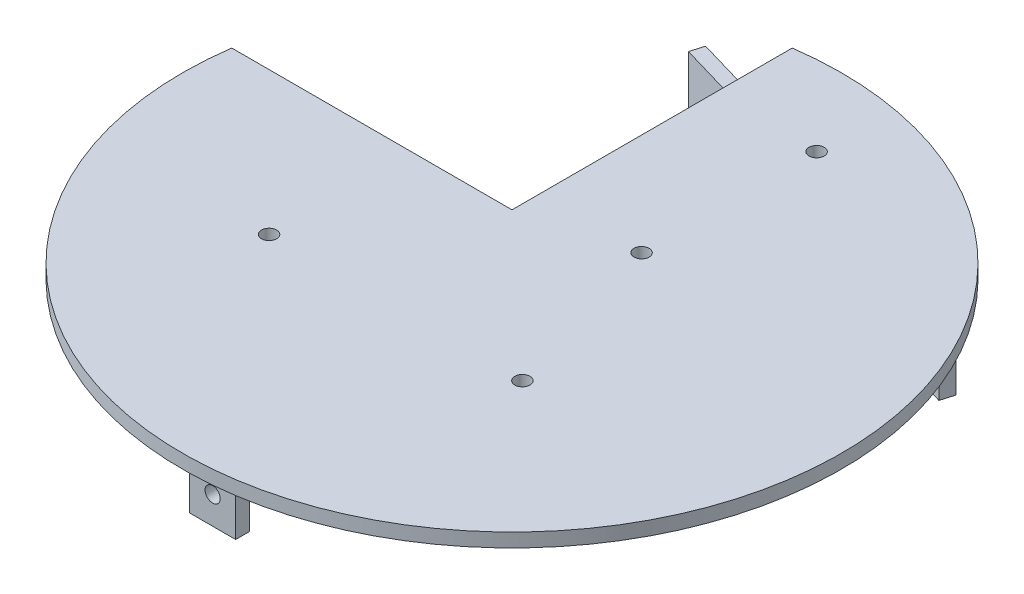
ISO-10303-21;
HEADER;
FILE_DESCRIPTION(('STEP AP214'),'2;1');
FILE_NAME('part.step','',(''),(''),'','','');
FILE_SCHEMA(('AUTOMOTIVE_DESIGN { 1 0 10303 214 1 1 1 1 }'));
ENDSEC;
DATA;
#1=APPLICATION_CONTEXT('core data for automotive mechanical design processes');
#2=APPLICATION_PROTOCOL_DEFINITION('international standard','automotive_design',2000,#1);
#3=PRODUCT_CONTEXT('',#1,'mechanical');
#4=PRODUCT('Part','Part','',(#3));
#5=PRODUCT_RELATED_PRODUCT_CATEGORY('part','',(#4));
#6=PRODUCT_DEFINITION_FORMATION('','',#4);
#7=PRODUCT_DEFINITION_CONTEXT('part definition',#1,'design');
#8=PRODUCT_DEFINITION('design','',#6,#7);
#9=PRODUCT_DEFINITION_SHAPE('','',#8);
#10=(LENGTH_UNIT() NAMED_UNIT(*) SI_UNIT(.MILLI.,.METRE.));
#11=(NAMED_UNIT(*) PLANE_ANGLE_UNIT() SI_UNIT($,.RADIAN.));
#12=(NAMED_UNIT(*) SI_UNIT($,.STERADIAN.) SOLID_ANGLE_UNIT());
#13=UNCERTAINTY_MEASURE_WITH_UNIT(LENGTH_MEASURE(1.E-05),#10,'distance_accuracy_value','');
#14=(GEOMETRIC_REPRESENTATION_CONTEXT(3) GLOBAL_UNCERTAINTY_ASSIGNED_CONTEXT((#13)) GLOBAL_UNIT_ASSIGNED_CONTEXT((#10,
#11,#12)) REPRESENTATION_CONTEXT('',''));
#15=CARTESIAN_POINT('',(0.,0.,0.));
#16=DIRECTION('',(0.,0.,1.));
#17=DIRECTION('',(1.,0.,0.));
#18=AXIS2_PLACEMENT_3D('',#15,#16,#17);
#19=CARTESIAN_POINT('',(0.,0.,0.));
#20=DIRECTION('',(0.,1.,0.));
#21=DIRECTION('',(0.,0.,1.));
#22=AXIS2_PLACEMENT_3D('',#19,#20,#21);
#23=PLANE('',#22);
#24=DIRECTION('',(0.959952117145582,0.,0.280164117594874));
#25=VECTOR('',#24,1.);
#26=CARTESIAN_POINT('',(-290184.643714966,0.,-84749.1679164852));
#27=LINE('',#26,#25);
#28=CARTESIAN_POINT('',(-9.99999999993861,0.,-61.065715569513));
#29=VERTEX_POINT('',#28);
#30=CARTESIAN_POINT('',(10.8113995060544,0.,-54.9918632654588));
#31=VERTEX_POINT('',#30);
#32=EDGE_CURVE('E11',#29,#31,#27,.T.);
#33=ORIENTED_EDGE('',*,*,#32,.F.);
#34=DIRECTION('',(0.,0.,1.));
#35=VECTOR('',#34,1.);
#36=CARTESIAN_POINT('',(-10.,0.,-70.8426921072315));
#37=LINE('',#36,#35);
#38=CARTESIAN_POINT('',(-10.,0.,-70.8426921072315));
#39=VERTEX_POINT('',#38);
#40=EDGE_CURVE('E238',#39,#29,#37,.T.);
#41=ORIENTED_EDGE('',*,*,#40,.F.);
#42=CARTESIAN_POINT('',(0.,0.,0.));
#43=DIRECTION('',(0.,1.,0.));
#44=DIRECTION('',(0.,0.,1.));
#45=AXIS2_PLACEMENT_3D('',#42,#43,#44);
#46=CIRCLE('',#45,71.545);
#47=CARTESIAN_POINT('',(-70.8426921072315,0.,-10.));
#48=VERTEX_POINT('',#47);
#49=EDGE_CURVE('E232',#48,#39,#46,.T.);
#50=ORIENTED_EDGE('',*,*,#49,.F.);
#51=DIRECTION('',(-1.,0.,0.));
#52=VECTOR('',#51,1.);
#53=CARTESIAN_POINT('',(-70.8426921072315,0.,-10.));
#54=LINE('',#53,#52);
#55=CARTESIAN_POINT('',(-10.,0.,-10.));
#56=VERTEX_POINT('',#55);
#57=EDGE_CURVE('E241',#56,#48,#54,.T.);
#58=ORIENTED_EDGE('',*,*,#57,.F.);
#59=CARTESIAN_POINT('',(-9.99999999993861,0.,-57.9405596931031));
#60=VERTEX_POINT('',#59);
#61=EDGE_CURVE('E225',#60,#56,#37,.T.);
#62=ORIENTED_EDGE('',*,*,#61,.F.);
#63=DIRECTION('',(-0.959952117145582,0.,-0.280164117594874));
#64=VECTOR('',#63,1.);
#65=CARTESIAN_POINT('',(-290185.484207319,0.,-84746.2880601338));
#66=LINE('',#65,#64);
#67=CARTESIAN_POINT('',(53.1959392302213,0.,-39.4966870939015));
#68=VERTEX_POINT('',#67);
#69=EDGE_CURVE('E181',#68,#60,#66,.T.);
#70=ORIENTED_EDGE('',*,*,#69,.F.);
#71=DIRECTION('',(-0.280164117594875,0.,0.959952117145582));
#72=VECTOR('',#71,1.);
#73=CARTESIAN_POINT('',(-109761.319853451,0.,376228.09187304));
#74=LINE('',#73,#72);
#75=CARTESIAN_POINT('',(54.0364315830004,0.,-42.3765434453003));
#76=VERTEX_POINT('',#75);
#77=EDGE_CURVE('E174',#76,#68,#74,.T.);
#78=ORIENTED_EDGE('',*,*,#77,.F.);
#79=CARTESIAN_POINT('',(13.7751131128112,0.,-54.126896989943));
#80=VERTEX_POINT('',#79);
#81=EDGE_CURVE('E48',#80,#76,#27,.T.);
#82=ORIENTED_EDGE('',*,*,#81,.F.);
#83=CARTESIAN_POINT('',(12.13,0.,-54.));
#84=DIRECTION('',(0.,1.,0.));
#85=DIRECTION('',(0.,0.,1.));
#86=AXIS2_PLACEMENT_3D('',#83,#84,#85);
#87=CIRCLE('',#86,1.65);
#88=EDGE_CURVE('E219',#80,#31,#87,.T.);
#89=ORIENTED_EDGE('',*,*,#88,.T.);
#90=EDGE_LOOP('',(#33,#41,#50,#58,#62,#70,#78,#82,#89));
#91=FACE_BOUND('',#90,.T.);
#92=CARTESIAN_POINT('',(12.13,0.,-16.));
#93=DIRECTION('',(0.,1.,0.));
#94=DIRECTION('',(0.,0.,1.));
#95=AXIS2_PLACEMENT_3D('',#92,#93,#94);
#96=CIRCLE('',#95,1.65);
#97=CARTESIAN_POINT('',(12.13,0.,-14.35));
#98=VERTEX_POINT('',#97);
#99=EDGE_CURVE('E218',#98,#98,#96,.T.);
#100=ORIENTED_EDGE('',*,*,#99,.T.);
#101=EDGE_LOOP('',(#100));
#102=FACE_BOUND('',#101,.T.);
#103=CARTESIAN_POINT('',(23.25,0.,21.));
#104=DIRECTION('',(0.,1.,0.));
#105=DIRECTION('',(0.,0.,1.));
#106=AXIS2_PLACEMENT_3D('',#103,#104,#105);
#107=CIRCLE('',#106,1.65);
#108=CARTESIAN_POINT('',(23.25,0.,22.65));
#109=VERTEX_POINT('',#108);
#110=EDGE_CURVE('E206',#109,#109,#107,.T.);
#111=ORIENTED_EDGE('',*,*,#110,.T.);
#112=EDGE_LOOP('',(#111));
#113=FACE_BOUND('',#112,.T.);
#114=CARTESIAN_POINT('',(-31.75,0.,21.));
#115=DIRECTION('',(0.,1.,0.));
#116=DIRECTION('',(0.,0.,1.));
#117=AXIS2_PLACEMENT_3D('',#114,#115,#116);
#118=CIRCLE('',#117,1.65);
#119=CARTESIAN_POINT('',(-31.75,0.,22.65));
#120=VERTEX_POINT('',#119);
#121=EDGE_CURVE('E202',#120,#120,#118,.T.);
#122=ORIENTED_EDGE('',*,*,#121,.T.);
#123=EDGE_LOOP('',(#122));
#124=FACE_BOUND('',#123,.T.);
#125=DIRECTION('',(0.,0.,-1.));
#126=VECTOR('',#125,1.);
#127=CARTESIAN_POINT('',(-5.,0.,62.));
#128=LINE('',#127,#126);
#129=CARTESIAN_POINT('',(-5.,0.,65.));
#130=VERTEX_POINT('',#129);
#131=CARTESIAN_POINT('',(-5.,0.,62.));
#132=VERTEX_POINT('',#131);
#133=EDGE_CURVE('E157',#130,#132,#128,.T.);
#134=ORIENTED_EDGE('',*,*,#133,.F.);
#135=DIRECTION('',(-1.,0.,0.));
#136=VECTOR('',#135,1.);
#137=CARTESIAN_POINT('',(-5.,0.,65.));
#138=LINE('',#137,#136);
#139=CARTESIAN_POINT('',(5.,0.,65.));
#140=VERTEX_POINT('',#139);
#141=EDGE_CURVE('E154',#140,#130,#138,.T.);
#142=ORIENTED_EDGE('',*,*,#141,.F.);
#143=DIRECTION('',(0.,0.,1.));
#144=VECTOR('',#143,1.);
#145=CARTESIAN_POINT('',(5.,0.,62.));
#146=LINE('',#145,#144);
#147=CARTESIAN_POINT('',(5.,0.,62.));
#148=VERTEX_POINT('',#147);
#149=EDGE_CURVE('E62',#148,#140,#146,.T.);
#150=ORIENTED_EDGE('',*,*,#149,.F.);
#151=DIRECTION('',(1.,0.,0.));
#152=VECTOR('',#151,1.);
#153=CARTESIAN_POINT('',(-5.,0.,62.));
#154=LINE('',#153,#152);
#155=EDGE_CURVE('E57',#132,#148,#154,.T.);
#156=ORIENTED_EDGE('',*,*,#155,.F.);
#157=EDGE_LOOP('',(#134,#142,#150,#156));
#158=FACE_BOUND('',#157,.T.);
#159=ADVANCED_FACE('F39',(#91,#102,#113,#124,#158),#23,.F.);
#160=CARTESIAN_POINT('',(0.,3.,0.));
#161=DIRECTION('',(0.,1.,0.));
#162=DIRECTION('',(0.,0.,1.));
#163=AXIS2_PLACEMENT_3D('',#160,#161,#162);
#164=PLANE('',#163);
#165=CARTESIAN_POINT('',(23.25,3.,21.));
#166=DIRECTION('',(0.,1.,0.));
#167=DIRECTION('',(0.,0.,1.));
#168=AXIS2_PLACEMENT_3D('',#165,#166,#167);
#169=CIRCLE('',#168,1.65);
#170=CARTESIAN_POINT('',(23.25,3.,22.65));
#171=VERTEX_POINT('',#170);
#172=EDGE_CURVE('E209',#171,#171,#169,.T.);
#173=ORIENTED_EDGE('',*,*,#172,.F.);
#174=EDGE_LOOP('',(#173));
#175=FACE_BOUND('',#174,.T.);
#176=CARTESIAN_POINT('',(12.13,3.,-16.));
#177=DIRECTION('',(0.,1.,0.));
#178=DIRECTION('',(0.,0.,1.));
#179=AXIS2_PLACEMENT_3D('',#176,#177,#178);
#180=CIRCLE('',#179,1.65);
#181=CARTESIAN_POINT('',(12.13,3.,-14.35));
#182=VERTEX_POINT('',#181);
#183=EDGE_CURVE('E222',#182,#182,#180,.T.);
#184=ORIENTED_EDGE('',*,*,#183,.F.);
#185=EDGE_LOOP('',(#184));
#186=FACE_BOUND('',#185,.T.);
#187=CARTESIAN_POINT('',(0.,3.,0.));
#188=DIRECTION('',(0.,1.,0.));
#189=DIRECTION('',(0.,0.,1.));
#190=AXIS2_PLACEMENT_3D('',#187,#188,#189);
#191=CIRCLE('',#190,71.545);
#192=CARTESIAN_POINT('',(-70.8426921072315,3.,-10.));
#193=VERTEX_POINT('',#192);
#194=CARTESIAN_POINT('',(-10.,3.,-70.8426921072315));
#195=VERTEX_POINT('',#194);
#196=EDGE_CURVE('E228',#193,#195,#191,.T.);
#197=ORIENTED_EDGE('',*,*,#196,.T.);
#198=DIRECTION('',(0.,0.,1.));
#199=VECTOR('',#198,1.);
#200=CARTESIAN_POINT('',(-10.,3.,-70.8426921072315));
#201=LINE('',#200,#199);
#202=CARTESIAN_POINT('',(-10.,3.,-10.));
#203=VERTEX_POINT('',#202);
#204=EDGE_CURVE('E231',#195,#203,#201,.T.);
#205=ORIENTED_EDGE('',*,*,#204,.T.);
#206=DIRECTION('',(-1.,0.,0.));
#207=VECTOR('',#206,1.);
#208=CARTESIAN_POINT('',(-70.8426921072315,3.,-10.));
#209=LINE('',#208,#207);
#210=EDGE_CURVE('E234',#203,#193,#209,.T.);
#211=ORIENTED_EDGE('',*,*,#210,.T.);
#212=EDGE_LOOP('',(#197,#205,#211));
#213=FACE_BOUND('',#212,.T.);
#214=CARTESIAN_POINT('',(12.13,3.,-54.));
#215=DIRECTION('',(0.,1.,0.));
#216=DIRECTION('',(0.,0.,1.));
#217=AXIS2_PLACEMENT_3D('',#214,#215,#216);
#218=CIRCLE('',#217,1.65);
#219=CARTESIAN_POINT('',(12.13,3.,-52.35));
#220=VERTEX_POINT('',#219);
#221=EDGE_CURVE('E215',#220,#220,#218,.T.);
#222=ORIENTED_EDGE('',*,*,#221,.F.);
#223=EDGE_LOOP('',(#222));
#224=FACE_BOUND('',#223,.T.);
#225=CARTESIAN_POINT('',(-31.75,3.,21.));
#226=DIRECTION('',(0.,1.,0.));
#227=DIRECTION('',(0.,0.,1.));
#228=AXIS2_PLACEMENT_3D('',#225,#226,#227);
#229=CIRCLE('',#228,1.65);
#230=CARTESIAN_POINT('',(-31.75,3.,22.65));
#231=VERTEX_POINT('',#230);
#232=EDGE_CURVE('E203',#231,#231,#229,.T.);
#233=ORIENTED_EDGE('',*,*,#232,.F.);
#234=EDGE_LOOP('',(#233));
#235=FACE_BOUND('',#234,.T.);
#236=ADVANCED_FACE('F306',(#175,#186,#213,#224,#235),#164,.T.);
#237=CARTESIAN_POINT('',(-10.,3.,-70.8426921072315));
#238=DIRECTION('',(1.,0.,0.));
#239=DIRECTION('',(0.,0.,-1.));
#240=AXIS2_PLACEMENT_3D('',#237,#238,#239);
#241=PLANE('',#240);
#242=ORIENTED_EDGE('',*,*,#40,.T.);
#243=EDGE_CURVE('E242',#29,#60,#37,.T.);
#244=ORIENTED_EDGE('',*,*,#243,.T.);
#245=ORIENTED_EDGE('',*,*,#61,.T.);
#246=DIRECTION('',(0.,-1.,0.));
#247=VECTOR('',#246,1.);
#248=CARTESIAN_POINT('',(-10.,3.,-10.));
#249=LINE('',#248,#247);
#250=EDGE_CURVE('E248',#203,#56,#249,.T.);
#251=ORIENTED_EDGE('',*,*,#250,.F.);
#252=ORIENTED_EDGE('',*,*,#204,.F.);
#253=DIRECTION('',(0.,-1.,0.));
#254=VECTOR('',#253,1.);
#255=CARTESIAN_POINT('',(-10.,3.,-70.8426921072315));
#256=LINE('',#255,#254);
#257=EDGE_CURVE('E251',#195,#39,#256,.T.);
#258=ORIENTED_EDGE('',*,*,#257,.T.);
#259=EDGE_LOOP('',(#242,#244,#245,#251,#252,#258));
#260=FACE_BOUND('',#259,.T.);
#261=ADVANCED_FACE('F41',(#260),#241,.F.);
#262=CARTESIAN_POINT('',(-70.8426921072315,3.,-10.));
#263=DIRECTION('',(0.,0.,1.));
#264=DIRECTION('',(1.,0.,0.));
#265=AXIS2_PLACEMENT_3D('',#262,#263,#264);
#266=PLANE('',#265);
#267=ORIENTED_EDGE('',*,*,#57,.T.);
#268=DIRECTION('',(0.,-1.,0.));
#269=VECTOR('',#268,1.);
#270=CARTESIAN_POINT('',(-70.8426921072315,3.,-10.));
#271=LINE('',#270,#269);
#272=EDGE_CURVE('E237',#193,#48,#271,.T.);
#273=ORIENTED_EDGE('',*,*,#272,.F.);
#274=ORIENTED_EDGE('',*,*,#210,.F.);
#275=ORIENTED_EDGE('',*,*,#250,.T.);
#276=EDGE_LOOP('',(#267,#273,#274,#275));
#277=FACE_BOUND('',#276,.T.);
#278=ADVANCED_FACE('F301',(#277),#266,.F.);
#279=CARTESIAN_POINT('',(0.,3.,0.));
#280=DIRECTION('',(0.,-1.,0.));
#281=DIRECTION('',(0.,0.,-1.));
#282=AXIS2_PLACEMENT_3D('',#279,#280,#281);
#283=CYLINDRICAL_SURFACE('',#282,71.545);
#284=ORIENTED_EDGE('',*,*,#49,.T.);
#285=ORIENTED_EDGE('',*,*,#257,.F.);
#286=ORIENTED_EDGE('',*,*,#196,.F.);
#287=ORIENTED_EDGE('',*,*,#272,.T.);
#288=EDGE_LOOP('',(#284,#285,#286,#287));
#289=FACE_BOUND('',#288,.T.);
#290=ADVANCED_FACE('F304',(#289),#283,.T.);
#291=CARTESIAN_POINT('',(12.13,3.,-16.));
#292=DIRECTION('',(0.,-1.,0.));
#293=DIRECTION('',(0.,0.,-1.));
#294=AXIS2_PLACEMENT_3D('',#291,#292,#293);
#295=CYLINDRICAL_SURFACE('',#294,1.65);
#296=ORIENTED_EDGE('',*,*,#183,.T.);
#297=EDGE_LOOP('',(#296));
#298=FACE_BOUND('',#297,.T.);
#299=ORIENTED_EDGE('',*,*,#99,.F.);
#300=EDGE_LOOP('',(#299));
#301=FACE_BOUND('',#300,.T.);
#302=ADVANCED_FACE('F391',(#298,#301),#295,.F.);
#303=CARTESIAN_POINT('',(12.13,3.,-54.));
#304=DIRECTION('',(0.,-1.,0.));
#305=DIRECTION('',(0.,0.,-1.));
#306=AXIS2_PLACEMENT_3D('',#303,#304,#305);
#307=CYLINDRICAL_SURFACE('',#306,1.65);
#308=ORIENTED_EDGE('',*,*,#221,.T.);
#309=EDGE_LOOP('',(#308));
#310=FACE_BOUND('',#309,.T.);
#311=ORIENTED_EDGE('',*,*,#88,.F.);
#312=EDGE_CURVE('E212',#31,#80,#87,.T.);
#313=ORIENTED_EDGE('',*,*,#312,.F.);
#314=EDGE_LOOP('',(#311,#313));
#315=FACE_BOUND('',#314,.T.);
#316=ADVANCED_FACE('F292',(#310,#315),#307,.F.);
#317=CARTESIAN_POINT('',(23.25,3.,21.));
#318=DIRECTION('',(0.,-1.,0.));
#319=DIRECTION('',(0.,0.,-1.));
#320=AXIS2_PLACEMENT_3D('',#317,#318,#319);
#321=CYLINDRICAL_SURFACE('',#320,1.65);
#322=ORIENTED_EDGE('',*,*,#172,.T.);
#323=EDGE_LOOP('',(#322));
#324=FACE_BOUND('',#323,.T.);
#325=ORIENTED_EDGE('',*,*,#110,.F.);
#326=EDGE_LOOP('',(#325));
#327=FACE_BOUND('',#326,.T.);
#328=ADVANCED_FACE('F318',(#324,#327),#321,.F.);
#329=CARTESIAN_POINT('',(-31.75,3.,21.));
#330=DIRECTION('',(0.,-1.,0.));
#331=DIRECTION('',(0.,0.,-1.));
#332=AXIS2_PLACEMENT_3D('',#329,#330,#331);
#333=CYLINDRICAL_SURFACE('',#332,1.65);
#334=ORIENTED_EDGE('',*,*,#232,.T.);
#335=EDGE_LOOP('',(#334));
#336=FACE_BOUND('',#335,.T.);
#337=ORIENTED_EDGE('',*,*,#121,.F.);
#338=EDGE_LOOP('',(#337));
#339=FACE_BOUND('',#338,.T.);
#340=ADVANCED_FACE('F315',(#336,#339),#333,.F.);
#341=CARTESIAN_POINT('',(0.,0.,0.));
#342=DIRECTION('',(0.,-1.,0.));
#343=DIRECTION('',(0.,0.,-1.));
#344=AXIS2_PLACEMENT_3D('',#341,#342,#343);
#345=PLANE('',#344);
#346=EDGE_CURVE('E50',#31,#80,#27,.T.);
#347=ORIENTED_EDGE('',*,*,#346,.F.);
#348=ORIENTED_EDGE('',*,*,#312,.T.);
#349=EDGE_LOOP('',(#347,#348));
#350=FACE_BOUND('',#349,.T.);
#351=ADVANCED_FACE('F290',(#350),#345,.F.);
#352=CARTESIAN_POINT('',(-290185.484207319,-16.,-84746.2880601338));
#353=DIRECTION('',(0.280164117594874,0.,-0.959952117145582));
#354=DIRECTION('',(-0.959952117145582,0.,-0.280164117594874));
#355=AXIS2_PLACEMENT_3D('',#352,#353,#354);
#356=PLANE('',#355);
#357=CARTESIAN_POINT('',(-14.9606610871295,-8.,-59.3883394431412));
#358=DIRECTION('',(-0.280164117594872,0.,0.959952117145583));
#359=DIRECTION('',(0.959952117145583,0.,0.280164117594872));
#360=AXIS2_PLACEMENT_3D('',#357,#358,#359);
#361=CIRCLE('',#360,1.65);
#362=CARTESIAN_POINT('',(-13.3767400938393,-8.,-58.9260686491096));
#363=VERTEX_POINT('',#362);
#364=EDGE_CURVE('E161',#363,#363,#361,.T.);
#365=ORIENTED_EDGE('',*,*,#364,.F.);
#366=EDGE_LOOP('',(#365));
#367=FACE_BOUND('',#366,.T.);
#368=CARTESIAN_POINT('',(44.5563701758966,-8.,-42.0181641522591));
#369=DIRECTION('',(-0.280164117594872,0.,0.959952117145583));
#370=DIRECTION('',(0.959952117145583,0.,0.280164117594872));
#371=AXIS2_PLACEMENT_3D('',#368,#369,#370);
#372=CIRCLE('',#371,1.65);
#373=CARTESIAN_POINT('',(46.1402911691868,-8.,-41.5558933582275));
#374=VERTEX_POINT('',#373);
#375=EDGE_CURVE('E158',#374,#374,#372,.T.);
#376=ORIENTED_EDGE('',*,*,#375,.F.);
#377=EDGE_LOOP('',(#376));
#378=FACE_BOUND('',#377,.T.);
#379=ORIENTED_EDGE('',*,*,#69,.T.);
#380=CARTESIAN_POINT('',(-23.6002301414544,0.,-61.9098165014975));
#381=VERTEX_POINT('',#380);
#382=EDGE_CURVE('E185',#60,#381,#66,.T.);
#383=ORIENTED_EDGE('',*,*,#382,.T.);
#384=DIRECTION('',(0.,1.,0.));
#385=VECTOR('',#384,1.);
#386=CARTESIAN_POINT('',(-23.6002301414544,-16.,-61.9098165014975));
#387=LINE('',#386,#385);
#388=CARTESIAN_POINT('',(-23.6002301414544,-16.,-61.9098165014975));
#389=VERTEX_POINT('',#388);
#390=EDGE_CURVE('E199',#389,#381,#387,.T.);
#391=ORIENTED_EDGE('',*,*,#390,.F.);
#392=DIRECTION('',(-0.959952117145582,0.,-0.280164117594874));
#393=VECTOR('',#392,1.);
#394=CARTESIAN_POINT('',(-290185.484207319,-16.,-84746.2880601338));
#395=LINE('',#394,#393);
#396=CARTESIAN_POINT('',(53.1959392302213,-16.,-39.4966870939015));
#397=VERTEX_POINT('',#396);
#398=EDGE_CURVE('E170',#397,#389,#395,.T.);
#399=ORIENTED_EDGE('',*,*,#398,.F.);
#400=DIRECTION('',(0.,1.,0.));
#401=VECTOR('',#400,1.);
#402=CARTESIAN_POINT('',(53.1959392302213,-16.,-39.4966870939015));
#403=LINE('',#402,#401);
#404=EDGE_CURVE('E180',#397,#68,#403,.T.);
#405=ORIENTED_EDGE('',*,*,#404,.T.);
#406=EDGE_LOOP('',(#379,#383,#391,#399,#405));
#407=FACE_BOUND('',#406,.T.);
#408=ADVANCED_FACE('F263',(#367,#378,#407),#356,.F.);
#409=CARTESIAN_POINT('',(-109838.116022821,-16.,376205.678743632));
#410=DIRECTION('',(0.959952117145583,0.,0.280164117594872));
#411=DIRECTION('',(0.280164117594872,0.,-0.959952117145583));
#412=AXIS2_PLACEMENT_3D('',#409,#410,#411);
#413=PLANE('',#412);
#414=DIRECTION('',(0.280164117594872,0.,-0.959952117145583));
#415=VECTOR('',#414,1.);
#416=CARTESIAN_POINT('',(-109838.116022821,0.,376205.678743632));
#417=LINE('',#416,#415);
#418=CARTESIAN_POINT('',(-22.75973778859,0.,-64.7896728528536));
#419=VERTEX_POINT('',#418);
#420=EDGE_CURVE('E184',#381,#419,#417,.T.);
#421=ORIENTED_EDGE('',*,*,#420,.T.);
#422=DIRECTION('',(0.,1.,0.));
#423=VECTOR('',#422,1.);
#424=CARTESIAN_POINT('',(-22.75973778859,-16.,-64.7896728528536));
#425=LINE('',#424,#423);
#426=CARTESIAN_POINT('',(-22.75973778859,-16.,-64.7896728528536));
#427=VERTEX_POINT('',#426);
#428=EDGE_CURVE('E196',#427,#419,#425,.T.);
#429=ORIENTED_EDGE('',*,*,#428,.F.);
#430=DIRECTION('',(0.280164117594872,0.,-0.959952117145583));
#431=VECTOR('',#430,1.);
#432=CARTESIAN_POINT('',(-109838.116022821,-16.,376205.678743632));
#433=LINE('',#432,#431);
#434=EDGE_CURVE('E173',#389,#427,#433,.T.);
#435=ORIENTED_EDGE('',*,*,#434,.F.);
#436=ORIENTED_EDGE('',*,*,#390,.T.);
#437=EDGE_LOOP('',(#421,#429,#435,#436));
#438=FACE_BOUND('',#437,.T.);
#439=ADVANCED_FACE('F271',(#438),#413,.F.);
#440=CARTESIAN_POINT('',(-290184.643714966,-16.,-84749.1679164852));
#441=DIRECTION('',(-0.280164117594874,0.,0.959952117145582));
#442=DIRECTION('',(0.959952117145582,0.,0.280164117594874));
#443=AXIS2_PLACEMENT_3D('',#440,#441,#442);
#444=PLANE('',#443);
#445=CARTESIAN_POINT('',(-14.1201687343583,-8.,-62.268195794532));
#446=DIRECTION('',(-0.280164117594874,0.,0.959952117145582));
#447=DIRECTION('',(0.959952117145582,0.,0.280164117594874));
#448=AXIS2_PLACEMENT_3D('',#445,#446,#447);
#449=CIRCLE('',#448,1.65);
#450=CARTESIAN_POINT('',(-12.5362477410681,-8.,-61.8059250005004));
#451=VERTEX_POINT('',#450);
#452=EDGE_CURVE('E255',#451,#451,#449,.T.);
#453=ORIENTED_EDGE('',*,*,#452,.T.);
#454=EDGE_LOOP('',(#453));
#455=FACE_BOUND('',#454,.T.);
#456=CARTESIAN_POINT('',(45.3968625286718,-8.,-44.8980205036635));
#457=DIRECTION('',(-0.280164117594874,0.,0.959952117145582));
#458=DIRECTION('',(0.959952117145582,0.,0.280164117594874));
#459=AXIS2_PLACEMENT_3D('',#456,#457,#458);
#460=CIRCLE('',#459,1.65);
#461=CARTESIAN_POINT('',(46.980783521962,-8.,-44.435749709632));
#462=VERTEX_POINT('',#461);
#463=EDGE_CURVE('E168',#462,#462,#460,.T.);
#464=ORIENTED_EDGE('',*,*,#463,.T.);
#465=EDGE_LOOP('',(#464));
#466=FACE_BOUND('',#465,.T.);
#467=EDGE_CURVE('E186',#419,#29,#27,.T.);
#468=ORIENTED_EDGE('',*,*,#467,.T.);
#469=ORIENTED_EDGE('',*,*,#32,.T.);
#470=ORIENTED_EDGE('',*,*,#346,.T.);
#471=ORIENTED_EDGE('',*,*,#81,.T.);
#472=DIRECTION('',(0.,1.,0.));
#473=VECTOR('',#472,1.);
#474=CARTESIAN_POINT('',(54.0364315830004,-16.,-42.3765434453003));
#475=LINE('',#474,#473);
#476=CARTESIAN_POINT('',(54.0364315830004,-16.,-42.3765434453003));
#477=VERTEX_POINT('',#476);
#478=EDGE_CURVE('E193',#477,#76,#475,.T.);
#479=ORIENTED_EDGE('',*,*,#478,.F.);
#480=DIRECTION('',(0.959952117145582,0.,0.280164117594874));
#481=VECTOR('',#480,1.);
#482=CARTESIAN_POINT('',(-290184.643714966,-16.,-84749.1679164852));
#483=LINE('',#482,#481);
#484=EDGE_CURVE('E176',#427,#477,#483,.T.);
#485=ORIENTED_EDGE('',*,*,#484,.F.);
#486=ORIENTED_EDGE('',*,*,#428,.T.);
#487=EDGE_LOOP('',(#468,#469,#470,#471,#479,#485,#486));
#488=FACE_BOUND('',#487,.T.);
#489=ADVANCED_FACE('F286',(#455,#466,#488),#444,.F.);
#490=CARTESIAN_POINT('',(-109761.319853451,-16.,376228.09187304));
#491=DIRECTION('',(-0.959952117145582,0.,-0.280164117594875));
#492=DIRECTION('',(-0.280164117594875,0.,0.959952117145582));
#493=AXIS2_PLACEMENT_3D('',#490,#491,#492);
#494=PLANE('',#493);
#495=ORIENTED_EDGE('',*,*,#77,.T.);
#496=ORIENTED_EDGE('',*,*,#404,.F.);
#497=DIRECTION('',(-0.280164117594875,0.,0.959952117145582));
#498=VECTOR('',#497,1.);
#499=CARTESIAN_POINT('',(-109761.319853451,-16.,376228.09187304));
#500=LINE('',#499,#498);
#501=EDGE_CURVE('E178',#477,#397,#500,.T.);
#502=ORIENTED_EDGE('',*,*,#501,.F.);
#503=ORIENTED_EDGE('',*,*,#478,.T.);
#504=EDGE_LOOP('',(#495,#496,#502,#503));
#505=FACE_BOUND('',#504,.T.);
#506=ADVANCED_FACE('F278',(#505),#494,.F.);
#507=CARTESIAN_POINT('',(0.,-16.,0.));
#508=DIRECTION('',(0.,-1.,0.));
#509=DIRECTION('',(0.,0.,-1.));
#510=AXIS2_PLACEMENT_3D('',#507,#508,#509);
#511=PLANE('',#510);
#512=ORIENTED_EDGE('',*,*,#398,.T.);
#513=ORIENTED_EDGE('',*,*,#434,.T.);
#514=ORIENTED_EDGE('',*,*,#484,.T.);
#515=ORIENTED_EDGE('',*,*,#501,.T.);
#516=EDGE_LOOP('',(#512,#513,#514,#515));
#517=FACE_BOUND('',#516,.T.);
#518=ADVANCED_FACE('F274',(#517),#511,.T.);
#519=ORIENTED_EDGE('',*,*,#243,.F.);
#520=ORIENTED_EDGE('',*,*,#467,.F.);
#521=ORIENTED_EDGE('',*,*,#420,.F.);
#522=ORIENTED_EDGE('',*,*,#382,.F.);
#523=EDGE_LOOP('',(#519,#520,#521,#522));
#524=FACE_BOUND('',#523,.T.);
#525=ADVANCED_FACE('F268',(#524),#345,.F.);
#526=CARTESIAN_POINT('',(49.0389960574145,-8.,-57.3773980265884));
#527=DIRECTION('',(-0.280164117594872,0.,0.959952117145583));
#528=DIRECTION('',(0.959952117145583,0.,0.280164117594872));
#529=AXIS2_PLACEMENT_3D('',#526,#527,#528);
#530=CYLINDRICAL_SURFACE('',#529,1.65);
#531=ORIENTED_EDGE('',*,*,#375,.T.);
#532=EDGE_LOOP('',(#531));
#533=FACE_BOUND('',#532,.T.);
#534=ORIENTED_EDGE('',*,*,#463,.F.);
#535=EDGE_LOOP('',(#534));
#536=FACE_BOUND('',#535,.T.);
#537=ADVANCED_FACE('F368',(#533,#536),#530,.F.);
#538=CARTESIAN_POINT('',(-10.4780352056116,-8.,-74.7475733174705));
#539=DIRECTION('',(-0.280164117594872,0.,0.959952117145583));
#540=DIRECTION('',(0.959952117145583,0.,0.280164117594872));
#541=AXIS2_PLACEMENT_3D('',#538,#539,#540);
#542=CYLINDRICAL_SURFACE('',#541,1.65);
#543=ORIENTED_EDGE('',*,*,#364,.T.);
#544=EDGE_LOOP('',(#543));
#545=FACE_BOUND('',#544,.T.);
#546=ORIENTED_EDGE('',*,*,#452,.F.);
#547=EDGE_LOOP('',(#546));
#548=FACE_BOUND('',#547,.T.);
#549=ADVANCED_FACE('F365',(#545,#548),#542,.F.);
#550=CARTESIAN_POINT('',(-5.,-14.,62.));
#551=DIRECTION('',(1.,0.,0.));
#552=DIRECTION('',(0.,0.,-1.));
#553=AXIS2_PLACEMENT_3D('',#550,#551,#552);
#554=PLANE('',#553);
#555=ORIENTED_EDGE('',*,*,#133,.T.);
#556=DIRECTION('',(0.,1.,0.));
#557=VECTOR('',#556,1.);
#558=CARTESIAN_POINT('',(-5.,-14.,62.));
#559=LINE('',#558,#557);
#560=CARTESIAN_POINT('',(-5.,-14.,62.));
#561=VERTEX_POINT('',#560);
#562=EDGE_CURVE('E138',#561,#132,#559,.T.);
#563=ORIENTED_EDGE('',*,*,#562,.F.);
#564=DIRECTION('',(0.,0.,-1.));
#565=VECTOR('',#564,1.);
#566=CARTESIAN_POINT('',(-5.,-14.,62.));
#567=LINE('',#566,#565);
#568=CARTESIAN_POINT('',(-5.,-14.,65.));
#569=VERTEX_POINT('',#568);
#570=EDGE_CURVE('E145',#569,#561,#567,.T.);
#571=ORIENTED_EDGE('',*,*,#570,.F.);
#572=DIRECTION('',(0.,1.,0.));
#573=VECTOR('',#572,1.);
#574=CARTESIAN_POINT('',(-5.,-14.,65.));
#575=LINE('',#574,#573);
#576=EDGE_CURVE('E329',#569,#130,#575,.T.);
#577=ORIENTED_EDGE('',*,*,#576,.T.);
#578=EDGE_LOOP('',(#555,#563,#571,#577));
#579=FACE_BOUND('',#578,.T.);
#580=ADVANCED_FACE('F156',(#579),#554,.F.);
#581=CARTESIAN_POINT('',(-5.,-14.,62.));
#582=DIRECTION('',(0.,0.,1.));
#583=DIRECTION('',(1.,0.,0.));
#584=AXIS2_PLACEMENT_3D('',#581,#582,#583);
#585=PLANE('',#584);
#586=CARTESIAN_POINT('',(0.,-7.99881660436955,62.));
#587=DIRECTION('',(0.,0.,-1.));
#588=DIRECTION('',(-1.,0.,0.));
#589=AXIS2_PLACEMENT_3D('',#586,#587,#588);
#590=CIRCLE('',#589,1.65);
#591=CARTESIAN_POINT('',(-1.65,-7.99881660436955,62.));
#592=VERTEX_POINT('',#591);
#593=EDGE_CURVE('E338',#592,#592,#590,.T.);
#594=ORIENTED_EDGE('',*,*,#593,.F.);
#595=EDGE_LOOP('',(#594));
#596=FACE_BOUND('',#595,.T.);
#597=ORIENTED_EDGE('',*,*,#155,.T.);
#598=DIRECTION('',(0.,1.,0.));
#599=VECTOR('',#598,1.);
#600=CARTESIAN_POINT('',(5.,-14.,62.));
#601=LINE('',#600,#599);
#602=CARTESIAN_POINT('',(5.,-14.,62.));
#603=VERTEX_POINT('',#602);
#604=EDGE_CURVE('E141',#603,#148,#601,.T.);
#605=ORIENTED_EDGE('',*,*,#604,.F.);
#606=DIRECTION('',(1.,0.,0.));
#607=VECTOR('',#606,1.);
#608=CARTESIAN_POINT('',(-5.,-14.,62.));
#609=LINE('',#608,#607);
#610=EDGE_CURVE('E134',#561,#603,#609,.T.);
#611=ORIENTED_EDGE('',*,*,#610,.F.);
#612=ORIENTED_EDGE('',*,*,#562,.T.);
#613=EDGE_LOOP('',(#597,#605,#611,#612));
#614=FACE_BOUND('',#613,.T.);
#615=ADVANCED_FACE('F136',(#596,#614),#585,.F.);
#616=CARTESIAN_POINT('',(5.,-14.,62.));
#617=DIRECTION('',(-1.,0.,0.));
#618=DIRECTION('',(0.,0.,1.));
#619=AXIS2_PLACEMENT_3D('',#616,#617,#618);
#620=PLANE('',#619);
#621=ORIENTED_EDGE('',*,*,#149,.T.);
#622=DIRECTION('',(0.,1.,0.));
#623=VECTOR('',#622,1.);
#624=CARTESIAN_POINT('',(5.,-14.,65.));
#625=LINE('',#624,#623);
#626=CARTESIAN_POINT('',(5.,-14.,65.));
#627=VERTEX_POINT('',#626);
#628=EDGE_CURVE('E163',#627,#140,#625,.T.);
#629=ORIENTED_EDGE('',*,*,#628,.F.);
#630=DIRECTION('',(0.,0.,1.));
#631=VECTOR('',#630,1.);
#632=CARTESIAN_POINT('',(5.,-14.,62.));
#633=LINE('',#632,#631);
#634=EDGE_CURVE('E144',#603,#627,#633,.T.);
#635=ORIENTED_EDGE('',*,*,#634,.F.);
#636=ORIENTED_EDGE('',*,*,#604,.T.);
#637=EDGE_LOOP('',(#621,#629,#635,#636));
#638=FACE_BOUND('',#637,.T.);
#639=ADVANCED_FACE('F356',(#638),#620,.F.);
#640=CARTESIAN_POINT('',(-5.,-14.,65.));
#641=DIRECTION('',(0.,0.,-1.));
#642=DIRECTION('',(-1.,0.,0.));
#643=AXIS2_PLACEMENT_3D('',#640,#641,#642);
#644=PLANE('',#643);
#645=CARTESIAN_POINT('',(0.,-7.99881660436955,65.));
#646=DIRECTION('',(0.,0.,-1.));
#647=DIRECTION('',(-1.,0.,0.));
#648=AXIS2_PLACEMENT_3D('',#645,#646,#647);
#649=CIRCLE('',#648,1.65);
#650=CARTESIAN_POINT('',(-1.65,-7.99881660436955,65.));
#651=VERTEX_POINT('',#650);
#652=EDGE_CURVE('E43',#651,#651,#649,.T.);
#653=ORIENTED_EDGE('',*,*,#652,.T.);
#654=EDGE_LOOP('',(#653));
#655=FACE_BOUND('',#654,.T.);
#656=ORIENTED_EDGE('',*,*,#141,.T.);
#657=ORIENTED_EDGE('',*,*,#576,.F.);
#658=DIRECTION('',(-1.,0.,0.));
#659=VECTOR('',#658,1.);
#660=CARTESIAN_POINT('',(-5.,-14.,65.));
#661=LINE('',#660,#659);
#662=EDGE_CURVE('E150',#627,#569,#661,.T.);
#663=ORIENTED_EDGE('',*,*,#662,.F.);
#664=ORIENTED_EDGE('',*,*,#628,.T.);
#665=EDGE_LOOP('',(#656,#657,#663,#664));
#666=FACE_BOUND('',#665,.T.);
#667=ADVANCED_FACE('F328',(#655,#666),#644,.F.);
#668=CARTESIAN_POINT('',(0.,-14.,0.));
#669=DIRECTION('',(0.,1.,0.));
#670=DIRECTION('',(0.,0.,1.));
#671=AXIS2_PLACEMENT_3D('',#668,#669,#670);
#672=PLANE('',#671);
#673=ORIENTED_EDGE('',*,*,#570,.T.);
#674=ORIENTED_EDGE('',*,*,#610,.T.);
#675=ORIENTED_EDGE('',*,*,#634,.T.);
#676=ORIENTED_EDGE('',*,*,#662,.T.);
#677=EDGE_LOOP('',(#673,#674,#675,#676));
#678=FACE_BOUND('',#677,.T.);
#679=ADVANCED_FACE('F148',(#678),#672,.F.);
#680=CARTESIAN_POINT('',(0.,-7.99881660436955,76.));
#681=DIRECTION('',(0.,0.,-1.));
#682=DIRECTION('',(-1.,0.,0.));
#683=AXIS2_PLACEMENT_3D('',#680,#681,#682);
#684=CYLINDRICAL_SURFACE('',#683,1.65);
#685=ORIENTED_EDGE('',*,*,#593,.T.);
#686=EDGE_LOOP('',(#685));
#687=FACE_BOUND('',#686,.T.);
#688=ORIENTED_EDGE('',*,*,#652,.F.);
#689=EDGE_LOOP('',(#688));
#690=FACE_BOUND('',#689,.T.);
#691=ADVANCED_FACE('F346',(#687,#690),#684,.F.);
#692=CLOSED_SHELL('',(#159,#236,#261,#278,#290,#302,#316,#328,#340,#351,#408,#439,#489,#506,
#518,#525,#537,#549,#580,#615,#639,#667,#679,#691));
#693=MANIFOLD_SOLID_BREP('B2',#692);
#694=ADVANCED_BREP_SHAPE_REPRESENTATION('',(#18,#693),#14);
#695=SHAPE_DEFINITION_REPRESENTATION(#9,#694);
ENDSEC;
END-ISO-10303-21;
